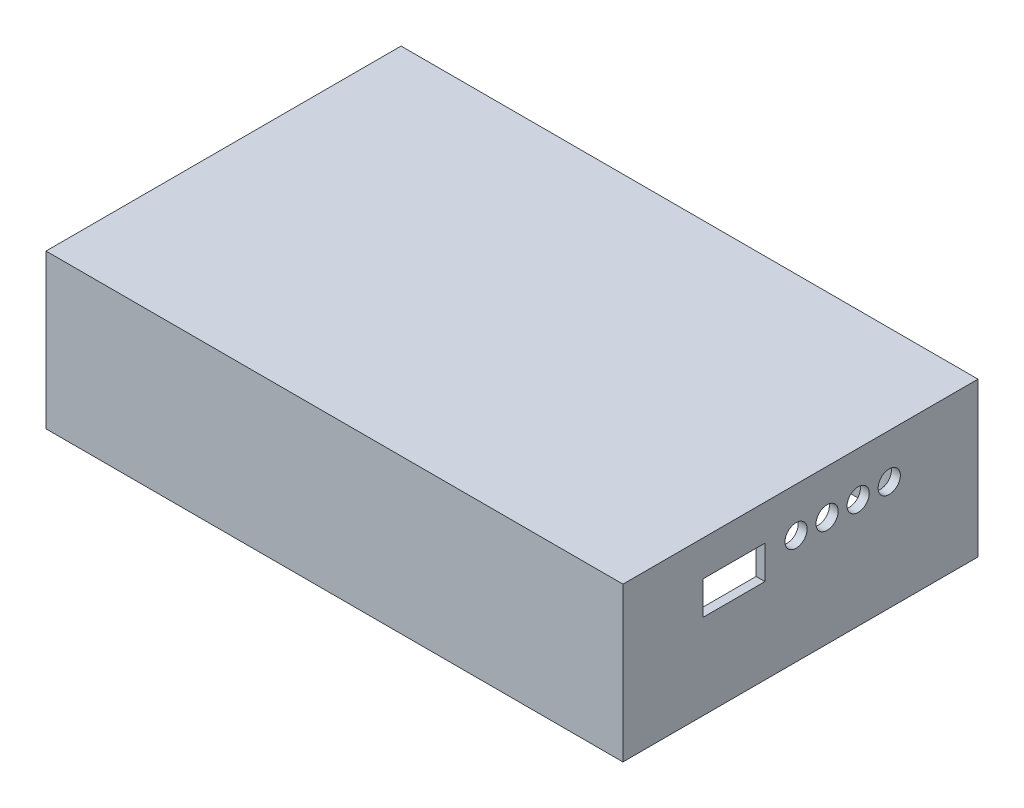
ISO-10303-21;
HEADER;
FILE_DESCRIPTION(('STEP AP214'),'2;1');
FILE_NAME('part.step','',(''),(''),'','','');
FILE_SCHEMA(('AUTOMOTIVE_DESIGN { 1 0 10303 214 1 1 1 1 }'));
ENDSEC;
DATA;
#1=APPLICATION_CONTEXT('core data for automotive mechanical design processes');
#2=APPLICATION_PROTOCOL_DEFINITION('international standard','automotive_design',2000,#1);
#3=PRODUCT_CONTEXT('',#1,'mechanical');
#4=PRODUCT('Part','Part','',(#3));
#5=PRODUCT_RELATED_PRODUCT_CATEGORY('part','',(#4));
#6=PRODUCT_DEFINITION_FORMATION('','',#4);
#7=PRODUCT_DEFINITION_CONTEXT('part definition',#1,'design');
#8=PRODUCT_DEFINITION('design','',#6,#7);
#9=PRODUCT_DEFINITION_SHAPE('','',#8);
#10=(LENGTH_UNIT() NAMED_UNIT(*) SI_UNIT(.MILLI.,.METRE.));
#11=(NAMED_UNIT(*) PLANE_ANGLE_UNIT() SI_UNIT($,.RADIAN.));
#12=(NAMED_UNIT(*) SI_UNIT($,.STERADIAN.) SOLID_ANGLE_UNIT());
#13=UNCERTAINTY_MEASURE_WITH_UNIT(LENGTH_MEASURE(1.E-05),#10,'distance_accuracy_value','');
#14=(GEOMETRIC_REPRESENTATION_CONTEXT(3) GLOBAL_UNCERTAINTY_ASSIGNED_CONTEXT((#13)) GLOBAL_UNIT_ASSIGNED_CONTEXT((#10,
#11,#12)) REPRESENTATION_CONTEXT('',''));
#15=CARTESIAN_POINT('',(0.,0.,0.));
#16=DIRECTION('',(0.,0.,1.));
#17=DIRECTION('',(1.,0.,0.));
#18=AXIS2_PLACEMENT_3D('',#15,#16,#17);
#19=CARTESIAN_POINT('',(0.,2.,0.));
#20=DIRECTION('',(-1.,0.,0.));
#21=DIRECTION('',(0.,0.,1.));
#22=AXIS2_PLACEMENT_3D('',#19,#20,#21);
#23=PLANE('',#22);
#24=DIRECTION('',(0.,-1.,0.));
#25=VECTOR('',#24,1.);
#26=CARTESIAN_POINT('',(0.,2.,-80.));
#27=LINE('',#26,#25);
#28=CARTESIAN_POINT('',(0.,2.,-80.));
#29=VERTEX_POINT('',#28);
#30=CARTESIAN_POINT('',(0.,-32.7,-80.));
#31=VERTEX_POINT('',#30);
#32=EDGE_CURVE('E284',#29,#31,#27,.T.);
#33=ORIENTED_EDGE('',*,*,#32,.T.);
#34=DIRECTION('',(0.,0.,-1.));
#35=VECTOR('',#34,1.);
#36=CARTESIAN_POINT('',(0.,-32.7,-80.));
#37=LINE('',#36,#35);
#38=CARTESIAN_POINT('',(0.,-32.7,0.));
#39=VERTEX_POINT('',#38);
#40=EDGE_CURVE('E262',#39,#31,#37,.T.);
#41=ORIENTED_EDGE('',*,*,#40,.F.);
#42=DIRECTION('',(0.,-1.,0.));
#43=VECTOR('',#42,1.);
#44=CARTESIAN_POINT('',(0.,2.,0.));
#45=LINE('',#44,#43);
#46=CARTESIAN_POINT('',(0.,2.,0.));
#47=VERTEX_POINT('',#46);
#48=EDGE_CURVE('E285',#47,#39,#45,.T.);
#49=ORIENTED_EDGE('',*,*,#48,.F.);
#50=DIRECTION('',(0.,0.,-1.));
#51=VECTOR('',#50,1.);
#52=CARTESIAN_POINT('',(0.,2.,0.));
#53=LINE('',#52,#51);
#54=EDGE_CURVE('E274',#47,#29,#53,.T.);
#55=ORIENTED_EDGE('',*,*,#54,.T.);
#56=EDGE_LOOP('',(#33,#41,#49,#55));
#57=FACE_BOUND('',#56,.T.);
#58=ADVANCED_FACE('F39',(#57),#23,.T.);
#59=CARTESIAN_POINT('',(0.,2.,0.));
#60=DIRECTION('',(0.,0.,-1.));
#61=DIRECTION('',(-1.,0.,0.));
#62=AXIS2_PLACEMENT_3D('',#59,#60,#61);
#63=PLANE('',#62);
#64=ORIENTED_EDGE('',*,*,#48,.T.);
#65=DIRECTION('',(-1.,0.,0.));
#66=VECTOR('',#65,1.);
#67=CARTESIAN_POINT('',(0.,-32.7,0.));
#68=LINE('',#67,#66);
#69=CARTESIAN_POINT('',(130.,-32.7,0.));
#70=VERTEX_POINT('',#69);
#71=EDGE_CURVE('E271',#70,#39,#68,.T.);
#72=ORIENTED_EDGE('',*,*,#71,.F.);
#73=DIRECTION('',(0.,-1.,0.));
#74=VECTOR('',#73,1.);
#75=CARTESIAN_POINT('',(130.,2.,0.));
#76=LINE('',#75,#74);
#77=CARTESIAN_POINT('',(130.,2.,0.));
#78=VERTEX_POINT('',#77);
#79=EDGE_CURVE('E288',#78,#70,#76,.T.);
#80=ORIENTED_EDGE('',*,*,#79,.F.);
#81=DIRECTION('',(1.,0.,0.));
#82=VECTOR('',#81,1.);
#83=CARTESIAN_POINT('',(0.,2.,0.));
#84=LINE('',#83,#82);
#85=EDGE_CURVE('E282',#47,#78,#84,.T.);
#86=ORIENTED_EDGE('',*,*,#85,.F.);
#87=EDGE_LOOP('',(#64,#72,#80,#86));
#88=FACE_BOUND('',#87,.T.);
#89=ADVANCED_FACE('F355',(#88),#63,.F.);
#90=CARTESIAN_POINT('',(130.,2.,0.));
#91=DIRECTION('',(-1.,0.,0.));
#92=DIRECTION('',(0.,0.,1.));
#93=AXIS2_PLACEMENT_3D('',#90,#91,#92);
#94=PLANE('',#93);
#95=DIRECTION('',(0.,0.,-1.));
#96=VECTOR('',#95,1.);
#97=CARTESIAN_POINT('',(130.,-13.5,-18.));
#98=LINE('',#97,#96);
#99=CARTESIAN_POINT('',(130.,-13.5,-18.));
#100=VERTEX_POINT('',#99);
#101=CARTESIAN_POINT('',(130.,-13.5,-32.));
#102=VERTEX_POINT('',#101);
#103=EDGE_CURVE('E163',#100,#102,#98,.T.);
#104=ORIENTED_EDGE('',*,*,#103,.F.);
#105=DIRECTION('',(0.,-1.,0.));
#106=VECTOR('',#105,1.);
#107=CARTESIAN_POINT('',(130.,-13.5,-18.));
#108=LINE('',#107,#106);
#109=CARTESIAN_POINT('',(130.,-6.,-18.));
#110=VERTEX_POINT('',#109);
#111=EDGE_CURVE('E53',#110,#100,#108,.T.);
#112=ORIENTED_EDGE('',*,*,#111,.F.);
#113=DIRECTION('',(0.,0.,1.));
#114=VECTOR('',#113,1.);
#115=CARTESIAN_POINT('',(130.,-6.,-18.));
#116=LINE('',#115,#114);
#117=CARTESIAN_POINT('',(130.,-6.,-32.));
#118=VERTEX_POINT('',#117);
#119=EDGE_CURVE('E170',#118,#110,#116,.T.);
#120=ORIENTED_EDGE('',*,*,#119,.F.);
#121=DIRECTION('',(0.,1.,0.));
#122=VECTOR('',#121,1.);
#123=CARTESIAN_POINT('',(130.,-13.5,-32.));
#124=LINE('',#123,#122);
#125=EDGE_CURVE('E154',#102,#118,#124,.T.);
#126=ORIENTED_EDGE('',*,*,#125,.F.);
#127=EDGE_LOOP('',(#104,#112,#120,#126));
#128=FACE_BOUND('',#127,.T.);
#129=CARTESIAN_POINT('',(130.,-8.,-39.));
#130=DIRECTION('',(1.,0.,0.));
#131=DIRECTION('',(0.,0.,-1.));
#132=AXIS2_PLACEMENT_3D('',#129,#130,#131);
#133=CIRCLE('',#132,2.5);
#134=CARTESIAN_POINT('',(130.,-8.,-41.5));
#135=VERTEX_POINT('',#134);
#136=EDGE_CURVE('E180',#135,#135,#133,.T.);
#137=ORIENTED_EDGE('',*,*,#136,.F.);
#138=EDGE_LOOP('',(#137));
#139=FACE_BOUND('',#138,.T.);
#140=CARTESIAN_POINT('',(130.,-8.,-46.));
#141=DIRECTION('',(1.,0.,0.));
#142=DIRECTION('',(0.,0.,-1.));
#143=AXIS2_PLACEMENT_3D('',#140,#141,#142);
#144=CIRCLE('',#143,2.5);
#145=CARTESIAN_POINT('',(130.,-8.,-48.5));
#146=VERTEX_POINT('',#145);
#147=EDGE_CURVE('E183',#146,#146,#144,.T.);
#148=ORIENTED_EDGE('',*,*,#147,.F.);
#149=EDGE_LOOP('',(#148));
#150=FACE_BOUND('',#149,.T.);
#151=CARTESIAN_POINT('',(130.,-8.,-53.));
#152=DIRECTION('',(1.,0.,0.));
#153=DIRECTION('',(0.,0.,-1.));
#154=AXIS2_PLACEMENT_3D('',#151,#152,#153);
#155=CIRCLE('',#154,2.49999999999999);
#156=CARTESIAN_POINT('',(130.,-8.,-55.5));
#157=VERTEX_POINT('',#156);
#158=EDGE_CURVE('E186',#157,#157,#155,.T.);
#159=ORIENTED_EDGE('',*,*,#158,.F.);
#160=EDGE_LOOP('',(#159));
#161=FACE_BOUND('',#160,.T.);
#162=CARTESIAN_POINT('',(130.,-8.,-60.));
#163=DIRECTION('',(1.,0.,0.));
#164=DIRECTION('',(0.,0.,-1.));
#165=AXIS2_PLACEMENT_3D('',#162,#163,#164);
#166=CIRCLE('',#165,2.50000000000002);
#167=CARTESIAN_POINT('',(130.,-8.,-62.5));
#168=VERTEX_POINT('',#167);
#169=EDGE_CURVE('E189',#168,#168,#166,.T.);
#170=ORIENTED_EDGE('',*,*,#169,.F.);
#171=EDGE_LOOP('',(#170));
#172=FACE_BOUND('',#171,.T.);
#173=ORIENTED_EDGE('',*,*,#79,.T.);
#174=DIRECTION('',(0.,0.,1.));
#175=VECTOR('',#174,1.);
#176=CARTESIAN_POINT('',(130.,-32.7,-80.));
#177=LINE('',#176,#175);
#178=CARTESIAN_POINT('',(130.,-32.7,-80.));
#179=VERTEX_POINT('',#178);
#180=EDGE_CURVE('E268',#179,#70,#177,.T.);
#181=ORIENTED_EDGE('',*,*,#180,.F.);
#182=DIRECTION('',(0.,-1.,0.));
#183=VECTOR('',#182,1.);
#184=CARTESIAN_POINT('',(130.,2.,-80.));
#185=LINE('',#184,#183);
#186=CARTESIAN_POINT('',(130.,2.,-80.));
#187=VERTEX_POINT('',#186);
#188=EDGE_CURVE('E290',#187,#179,#185,.T.);
#189=ORIENTED_EDGE('',*,*,#188,.F.);
#190=DIRECTION('',(0.,0.,-1.));
#191=VECTOR('',#190,1.);
#192=CARTESIAN_POINT('',(130.,2.,0.));
#193=LINE('',#192,#191);
#194=EDGE_CURVE('E280',#78,#187,#193,.T.);
#195=ORIENTED_EDGE('',*,*,#194,.F.);
#196=EDGE_LOOP('',(#173,#181,#189,#195));
#197=FACE_BOUND('',#196,.T.);
#198=ADVANCED_FACE('F167',(#128,#139,#150,#161,#172,#197),#94,.F.);
#199=CARTESIAN_POINT('',(0.,2.,-80.));
#200=DIRECTION('',(0.,0.,-1.));
#201=DIRECTION('',(-1.,0.,0.));
#202=AXIS2_PLACEMENT_3D('',#199,#200,#201);
#203=PLANE('',#202);
#204=ORIENTED_EDGE('',*,*,#188,.T.);
#205=DIRECTION('',(1.,0.,0.));
#206=VECTOR('',#205,1.);
#207=CARTESIAN_POINT('',(0.,-32.7,-80.));
#208=LINE('',#207,#206);
#209=EDGE_CURVE('E265',#31,#179,#208,.T.);
#210=ORIENTED_EDGE('',*,*,#209,.F.);
#211=ORIENTED_EDGE('',*,*,#32,.F.);
#212=DIRECTION('',(1.,0.,0.));
#213=VECTOR('',#212,1.);
#214=CARTESIAN_POINT('',(0.,2.,-80.));
#215=LINE('',#214,#213);
#216=EDGE_CURVE('E277',#29,#187,#215,.T.);
#217=ORIENTED_EDGE('',*,*,#216,.T.);
#218=EDGE_LOOP('',(#204,#210,#211,#217));
#219=FACE_BOUND('',#218,.T.);
#220=ADVANCED_FACE('F367',(#219),#203,.T.);
#221=CARTESIAN_POINT('',(0.,2.,0.));
#222=DIRECTION('',(0.,-1.,0.));
#223=DIRECTION('',(0.,0.,-1.));
#224=AXIS2_PLACEMENT_3D('',#221,#222,#223);
#225=PLANE('',#224);
#226=ORIENTED_EDGE('',*,*,#54,.F.);
#227=ORIENTED_EDGE('',*,*,#85,.T.);
#228=ORIENTED_EDGE('',*,*,#194,.T.);
#229=ORIENTED_EDGE('',*,*,#216,.F.);
#230=EDGE_LOOP('',(#226,#227,#228,#229));
#231=FACE_BOUND('',#230,.T.);
#232=ADVANCED_FACE('F331',(#231),#225,.F.);
#233=CARTESIAN_POINT('',(0.,-32.7,0.));
#234=DIRECTION('',(0.,1.,0.));
#235=DIRECTION('',(0.,0.,1.));
#236=AXIS2_PLACEMENT_3D('',#233,#234,#235);
#237=PLANE('',#236);
#238=ORIENTED_EDGE('',*,*,#40,.T.);
#239=ORIENTED_EDGE('',*,*,#209,.T.);
#240=ORIENTED_EDGE('',*,*,#180,.T.);
#241=ORIENTED_EDGE('',*,*,#71,.T.);
#242=EDGE_LOOP('',(#238,#239,#240,#241));
#243=FACE_BOUND('',#242,.T.);
#244=CARTESIAN_POINT('',(7.,-32.7,-73.));
#245=DIRECTION('',(0.,1.,0.));
#246=DIRECTION('',(0.,0.,-1.));
#247=AXIS2_PLACEMENT_3D('',#244,#245,#246);
#248=CIRCLE('',#247,7.);
#249=CARTESIAN_POINT('',(2.,-32.7,-68.1010205144336));
#250=VERTEX_POINT('',#249);
#251=CARTESIAN_POINT('',(11.8989794855664,-32.7,-78.));
#252=VERTEX_POINT('',#251);
#253=EDGE_CURVE('E206',#250,#252,#248,.T.);
#254=ORIENTED_EDGE('',*,*,#253,.F.);
#255=DIRECTION('',(0.,0.,-1.));
#256=VECTOR('',#255,1.);
#257=CARTESIAN_POINT('',(2.,-32.7,-68.1010205144336));
#258=LINE('',#257,#256);
#259=CARTESIAN_POINT('',(2.,-32.7,-11.8989794855664));
#260=VERTEX_POINT('',#259);
#261=EDGE_CURVE('E222',#260,#250,#258,.T.);
#262=ORIENTED_EDGE('',*,*,#261,.F.);
#263=CARTESIAN_POINT('',(7.,-32.7,-7.00000000000001));
#264=DIRECTION('',(0.,1.,0.));
#265=DIRECTION('',(0.,0.,-1.));
#266=AXIS2_PLACEMENT_3D('',#263,#264,#265);
#267=CIRCLE('',#266,7.);
#268=CARTESIAN_POINT('',(11.8989794855664,-32.7,-2.));
#269=VERTEX_POINT('',#268);
#270=EDGE_CURVE('E219',#269,#260,#267,.T.);
#271=ORIENTED_EDGE('',*,*,#270,.F.);
#272=DIRECTION('',(-1.,0.,0.));
#273=VECTOR('',#272,1.);
#274=CARTESIAN_POINT('',(11.8989794855664,-32.7,-2.));
#275=LINE('',#274,#273);
#276=CARTESIAN_POINT('',(118.101020514434,-32.7,-2.));
#277=VERTEX_POINT('',#276);
#278=EDGE_CURVE('E217',#277,#269,#275,.T.);
#279=ORIENTED_EDGE('',*,*,#278,.F.);
#280=CARTESIAN_POINT('',(123.,-32.7,-7.));
#281=DIRECTION('',(0.,1.,0.));
#282=DIRECTION('',(0.,0.,-1.));
#283=AXIS2_PLACEMENT_3D('',#280,#281,#282);
#284=CIRCLE('',#283,7.);
#285=CARTESIAN_POINT('',(128.,-32.7,-11.8989794855664));
#286=VERTEX_POINT('',#285);
#287=EDGE_CURVE('E215',#286,#277,#284,.T.);
#288=ORIENTED_EDGE('',*,*,#287,.F.);
#289=DIRECTION('',(0.,0.,1.));
#290=VECTOR('',#289,1.);
#291=CARTESIAN_POINT('',(128.,-32.7,-68.1010205144337));
#292=LINE('',#291,#290);
#293=CARTESIAN_POINT('',(128.,-32.7,-68.1010205144337));
#294=VERTEX_POINT('',#293);
#295=EDGE_CURVE('E213',#294,#286,#292,.T.);
#296=ORIENTED_EDGE('',*,*,#295,.F.);
#297=CARTESIAN_POINT('',(123.,-32.7,-73.));
#298=DIRECTION('',(0.,1.,0.));
#299=DIRECTION('',(0.,0.,-1.));
#300=AXIS2_PLACEMENT_3D('',#297,#298,#299);
#301=CIRCLE('',#300,7.);
#302=CARTESIAN_POINT('',(118.101020514434,-32.7,-78.));
#303=VERTEX_POINT('',#302);
#304=EDGE_CURVE('E211',#303,#294,#301,.T.);
#305=ORIENTED_EDGE('',*,*,#304,.F.);
#306=DIRECTION('',(1.,0.,0.));
#307=VECTOR('',#306,1.);
#308=CARTESIAN_POINT('',(11.8989794855664,-32.7,-78.));
#309=LINE('',#308,#307);
#310=EDGE_CURVE('E208',#252,#303,#309,.T.);
#311=ORIENTED_EDGE('',*,*,#310,.F.);
#312=EDGE_LOOP('',(#254,#262,#271,#279,#288,#296,#305,#311));
#313=FACE_BOUND('',#312,.T.);
#314=CARTESIAN_POINT('',(123.,-32.7,-7.));
#315=DIRECTION('',(0.,-1.,0.));
#316=DIRECTION('',(0.,0.,-1.));
#317=AXIS2_PLACEMENT_3D('',#314,#315,#316);
#318=CIRCLE('',#317,5.09999999999998);
#319=CARTESIAN_POINT('',(123.,-32.7,-12.1));
#320=VERTEX_POINT('',#319);
#321=EDGE_CURVE('E202',#320,#320,#318,.T.);
#322=ORIENTED_EDGE('',*,*,#321,.F.);
#323=EDGE_LOOP('',(#322));
#324=FACE_BOUND('',#323,.T.);
#325=CARTESIAN_POINT('',(123.,-32.7,-73.));
#326=DIRECTION('',(0.,-1.,0.));
#327=DIRECTION('',(0.,0.,-1.));
#328=AXIS2_PLACEMENT_3D('',#325,#326,#327);
#329=CIRCLE('',#328,5.09999999999998);
#330=CARTESIAN_POINT('',(123.,-32.7,-78.1));
#331=VERTEX_POINT('',#330);
#332=EDGE_CURVE('E199',#331,#331,#329,.T.);
#333=ORIENTED_EDGE('',*,*,#332,.F.);
#334=EDGE_LOOP('',(#333));
#335=FACE_BOUND('',#334,.T.);
#336=CARTESIAN_POINT('',(7.,-32.7,-7.00000000000001));
#337=DIRECTION('',(0.,-1.,0.));
#338=DIRECTION('',(0.,0.,-1.));
#339=AXIS2_PLACEMENT_3D('',#336,#337,#338);
#340=CIRCLE('',#339,5.1);
#341=CARTESIAN_POINT('',(7.,-32.7,-12.1));
#342=VERTEX_POINT('',#341);
#343=EDGE_CURVE('E195',#342,#342,#340,.T.);
#344=ORIENTED_EDGE('',*,*,#343,.F.);
#345=EDGE_LOOP('',(#344));
#346=FACE_BOUND('',#345,.T.);
#347=CARTESIAN_POINT('',(7.,-32.7,-73.));
#348=DIRECTION('',(0.,-1.,0.));
#349=DIRECTION('',(0.,0.,-1.));
#350=AXIS2_PLACEMENT_3D('',#347,#348,#349);
#351=CIRCLE('',#350,5.1);
#352=CARTESIAN_POINT('',(7.,-32.7,-78.1));
#353=VERTEX_POINT('',#352);
#354=EDGE_CURVE('E192',#353,#353,#351,.T.);
#355=ORIENTED_EDGE('',*,*,#354,.F.);
#356=EDGE_LOOP('',(#355));
#357=FACE_BOUND('',#356,.T.);
#358=ADVANCED_FACE('F327',(#243,#313,#324,#335,#346,#357),#237,.F.);
#359=CARTESIAN_POINT('',(7.,-32.7,-73.));
#360=DIRECTION('',(0.,1.,0.));
#361=DIRECTION('',(0.,0.,1.));
#362=AXIS2_PLACEMENT_3D('',#359,#360,#361);
#363=CYLINDRICAL_SURFACE('',#362,7.);
#364=CARTESIAN_POINT('',(7.,0.,-73.));
#365=DIRECTION('',(0.,1.,0.));
#366=DIRECTION('',(0.,0.,-1.));
#367=AXIS2_PLACEMENT_3D('',#364,#365,#366);
#368=CIRCLE('',#367,7.);
#369=CARTESIAN_POINT('',(2.,0.,-68.1010205144336));
#370=VERTEX_POINT('',#369);
#371=CARTESIAN_POINT('',(11.8989794855664,0.,-78.));
#372=VERTEX_POINT('',#371);
#373=EDGE_CURVE('E205',#370,#372,#368,.T.);
#374=ORIENTED_EDGE('',*,*,#373,.F.);
#375=DIRECTION('',(0.,1.,0.));
#376=VECTOR('',#375,1.);
#377=CARTESIAN_POINT('',(2.,-32.7,-68.1010205144336));
#378=LINE('',#377,#376);
#379=EDGE_CURVE('E224',#250,#370,#378,.T.);
#380=ORIENTED_EDGE('',*,*,#379,.F.);
#381=ORIENTED_EDGE('',*,*,#253,.T.);
#382=DIRECTION('',(0.,1.,0.));
#383=VECTOR('',#382,1.);
#384=CARTESIAN_POINT('',(11.8989794855664,-32.7,-78.));
#385=LINE('',#384,#383);
#386=EDGE_CURVE('E259',#252,#372,#385,.T.);
#387=ORIENTED_EDGE('',*,*,#386,.T.);
#388=EDGE_LOOP('',(#374,#380,#381,#387));
#389=FACE_BOUND('',#388,.T.);
#390=ADVANCED_FACE('F330',(#389),#363,.T.);
#391=CARTESIAN_POINT('',(11.8989794855664,-32.7,-78.));
#392=DIRECTION('',(0.,0.,1.));
#393=DIRECTION('',(1.,0.,0.));
#394=AXIS2_PLACEMENT_3D('',#391,#392,#393);
#395=PLANE('',#394);
#396=DIRECTION('',(1.,0.,0.));
#397=VECTOR('',#396,1.);
#398=CARTESIAN_POINT('',(11.8989794855664,0.,-78.));
#399=LINE('',#398,#397);
#400=CARTESIAN_POINT('',(118.101020514434,0.,-78.));
#401=VERTEX_POINT('',#400);
#402=EDGE_CURVE('E226',#372,#401,#399,.T.);
#403=ORIENTED_EDGE('',*,*,#402,.F.);
#404=ORIENTED_EDGE('',*,*,#386,.F.);
#405=ORIENTED_EDGE('',*,*,#310,.T.);
#406=DIRECTION('',(0.,1.,0.));
#407=VECTOR('',#406,1.);
#408=CARTESIAN_POINT('',(118.101020514434,-32.7,-78.));
#409=LINE('',#408,#407);
#410=EDGE_CURVE('E256',#303,#401,#409,.T.);
#411=ORIENTED_EDGE('',*,*,#410,.T.);
#412=EDGE_LOOP('',(#403,#404,#405,#411));
#413=FACE_BOUND('',#412,.T.);
#414=ADVANCED_FACE('F387',(#413),#395,.T.);
#415=CARTESIAN_POINT('',(123.,-32.7,-73.));
#416=DIRECTION('',(0.,1.,0.));
#417=DIRECTION('',(0.,0.,1.));
#418=AXIS2_PLACEMENT_3D('',#415,#416,#417);
#419=CYLINDRICAL_SURFACE('',#418,7.);
#420=CARTESIAN_POINT('',(123.,0.,-73.));
#421=DIRECTION('',(0.,1.,0.));
#422=DIRECTION('',(0.,0.,-1.));
#423=AXIS2_PLACEMENT_3D('',#420,#421,#422);
#424=CIRCLE('',#423,7.);
#425=CARTESIAN_POINT('',(128.,0.,-68.1010205144337));
#426=VERTEX_POINT('',#425);
#427=EDGE_CURVE('E228',#401,#426,#424,.T.);
#428=ORIENTED_EDGE('',*,*,#427,.F.);
#429=ORIENTED_EDGE('',*,*,#410,.F.);
#430=ORIENTED_EDGE('',*,*,#304,.T.);
#431=DIRECTION('',(0.,1.,0.));
#432=VECTOR('',#431,1.);
#433=CARTESIAN_POINT('',(128.,-32.7,-68.1010205144337));
#434=LINE('',#433,#432);
#435=EDGE_CURVE('E253',#294,#426,#434,.T.);
#436=ORIENTED_EDGE('',*,*,#435,.T.);
#437=EDGE_LOOP('',(#428,#429,#430,#436));
#438=FACE_BOUND('',#437,.T.);
#439=ADVANCED_FACE('F391',(#438),#419,.T.);
#440=CARTESIAN_POINT('',(128.,-32.7,-68.1010205144337));
#441=DIRECTION('',(-1.,0.,0.));
#442=DIRECTION('',(0.,0.,1.));
#443=AXIS2_PLACEMENT_3D('',#440,#441,#442);
#444=PLANE('',#443);
#445=DIRECTION('',(0.,1.,0.));
#446=VECTOR('',#445,1.);
#447=CARTESIAN_POINT('',(128.,-32.7,-18.));
#448=LINE('',#447,#446);
#449=CARTESIAN_POINT('',(128.,-13.5,-18.));
#450=VERTEX_POINT('',#449);
#451=CARTESIAN_POINT('',(128.,-6.,-18.));
#452=VERTEX_POINT('',#451);
#453=EDGE_CURVE('E307',#450,#452,#448,.T.);
#454=ORIENTED_EDGE('',*,*,#453,.F.);
#455=DIRECTION('',(0.,0.,1.));
#456=VECTOR('',#455,1.);
#457=CARTESIAN_POINT('',(128.,-13.5,-68.1010205144337));
#458=LINE('',#457,#456);
#459=CARTESIAN_POINT('',(128.,-13.5,-32.));
#460=VERTEX_POINT('',#459);
#461=EDGE_CURVE('E287',#460,#450,#458,.T.);
#462=ORIENTED_EDGE('',*,*,#461,.F.);
#463=DIRECTION('',(0.,-1.,0.));
#464=VECTOR('',#463,1.);
#465=CARTESIAN_POINT('',(128.,-32.7,-32.));
#466=LINE('',#465,#464);
#467=CARTESIAN_POINT('',(128.,-6.,-32.));
#468=VERTEX_POINT('',#467);
#469=EDGE_CURVE('E157',#468,#460,#466,.T.);
#470=ORIENTED_EDGE('',*,*,#469,.F.);
#471=DIRECTION('',(0.,0.,-1.));
#472=VECTOR('',#471,1.);
#473=CARTESIAN_POINT('',(128.,-6.,-68.1010205144337));
#474=LINE('',#473,#472);
#475=EDGE_CURVE('E305',#452,#468,#474,.T.);
#476=ORIENTED_EDGE('',*,*,#475,.F.);
#477=EDGE_LOOP('',(#454,#462,#470,#476));
#478=FACE_BOUND('',#477,.T.);
#479=CARTESIAN_POINT('',(128.,-8.,-39.));
#480=DIRECTION('',(-1.,0.,0.));
#481=DIRECTION('',(0.,0.,1.));
#482=AXIS2_PLACEMENT_3D('',#479,#480,#481);
#483=CIRCLE('',#482,2.5);
#484=CARTESIAN_POINT('',(128.,-8.,-36.5));
#485=VERTEX_POINT('',#484);
#486=EDGE_CURVE('E196',#485,#485,#483,.T.);
#487=ORIENTED_EDGE('',*,*,#486,.F.);
#488=EDGE_LOOP('',(#487));
#489=FACE_BOUND('',#488,.T.);
#490=CARTESIAN_POINT('',(128.,-8.,-46.));
#491=DIRECTION('',(-1.,0.,0.));
#492=DIRECTION('',(0.,0.,1.));
#493=AXIS2_PLACEMENT_3D('',#490,#491,#492);
#494=CIRCLE('',#493,2.5);
#495=CARTESIAN_POINT('',(128.,-8.,-43.5));
#496=VERTEX_POINT('',#495);
#497=EDGE_CURVE('E298',#496,#496,#494,.T.);
#498=ORIENTED_EDGE('',*,*,#497,.F.);
#499=EDGE_LOOP('',(#498));
#500=FACE_BOUND('',#499,.T.);
#501=CARTESIAN_POINT('',(128.,-8.,-53.));
#502=DIRECTION('',(-1.,0.,0.));
#503=DIRECTION('',(0.,0.,1.));
#504=AXIS2_PLACEMENT_3D('',#501,#502,#503);
#505=CIRCLE('',#504,2.49999999999999);
#506=CARTESIAN_POINT('',(128.,-8.,-50.5));
#507=VERTEX_POINT('',#506);
#508=EDGE_CURVE('E295',#507,#507,#505,.T.);
#509=ORIENTED_EDGE('',*,*,#508,.F.);
#510=EDGE_LOOP('',(#509));
#511=FACE_BOUND('',#510,.T.);
#512=CARTESIAN_POINT('',(128.,-8.,-60.));
#513=DIRECTION('',(-1.,0.,0.));
#514=DIRECTION('',(0.,0.,1.));
#515=AXIS2_PLACEMENT_3D('',#512,#513,#514);
#516=CIRCLE('',#515,2.50000000000002);
#517=CARTESIAN_POINT('',(128.,-8.,-57.5));
#518=VERTEX_POINT('',#517);
#519=EDGE_CURVE('E177',#518,#518,#516,.T.);
#520=ORIENTED_EDGE('',*,*,#519,.F.);
#521=EDGE_LOOP('',(#520));
#522=FACE_BOUND('',#521,.T.);
#523=DIRECTION('',(0.,0.,1.));
#524=VECTOR('',#523,1.);
#525=CARTESIAN_POINT('',(128.,0.,-68.1010205144337));
#526=LINE('',#525,#524);
#527=CARTESIAN_POINT('',(128.,0.,-11.8989794855664));
#528=VERTEX_POINT('',#527);
#529=EDGE_CURVE('E230',#426,#528,#526,.T.);
#530=ORIENTED_EDGE('',*,*,#529,.F.);
#531=ORIENTED_EDGE('',*,*,#435,.F.);
#532=ORIENTED_EDGE('',*,*,#295,.T.);
#533=DIRECTION('',(0.,1.,0.));
#534=VECTOR('',#533,1.);
#535=CARTESIAN_POINT('',(128.,-32.7,-11.8989794855664));
#536=LINE('',#535,#534);
#537=EDGE_CURVE('E250',#286,#528,#536,.T.);
#538=ORIENTED_EDGE('',*,*,#537,.T.);
#539=EDGE_LOOP('',(#530,#531,#532,#538));
#540=FACE_BOUND('',#539,.T.);
#541=ADVANCED_FACE('F395',(#478,#489,#500,#511,#522,#540),#444,.T.);
#542=CARTESIAN_POINT('',(123.,-32.7,-7.));
#543=DIRECTION('',(0.,1.,0.));
#544=DIRECTION('',(0.,0.,1.));
#545=AXIS2_PLACEMENT_3D('',#542,#543,#544);
#546=CYLINDRICAL_SURFACE('',#545,7.);
#547=CARTESIAN_POINT('',(123.,0.,-7.));
#548=DIRECTION('',(0.,1.,0.));
#549=DIRECTION('',(0.,0.,-1.));
#550=AXIS2_PLACEMENT_3D('',#547,#548,#549);
#551=CIRCLE('',#550,7.);
#552=CARTESIAN_POINT('',(118.101020514434,0.,-2.));
#553=VERTEX_POINT('',#552);
#554=EDGE_CURVE('E232',#528,#553,#551,.T.);
#555=ORIENTED_EDGE('',*,*,#554,.F.);
#556=ORIENTED_EDGE('',*,*,#537,.F.);
#557=ORIENTED_EDGE('',*,*,#287,.T.);
#558=DIRECTION('',(0.,1.,0.));
#559=VECTOR('',#558,1.);
#560=CARTESIAN_POINT('',(118.101020514434,-32.7,-2.));
#561=LINE('',#560,#559);
#562=EDGE_CURVE('E247',#277,#553,#561,.T.);
#563=ORIENTED_EDGE('',*,*,#562,.T.);
#564=EDGE_LOOP('',(#555,#556,#557,#563));
#565=FACE_BOUND('',#564,.T.);
#566=ADVANCED_FACE('F399',(#565),#546,.T.);
#567=CARTESIAN_POINT('',(11.8989794855664,-32.7,-2.));
#568=DIRECTION('',(0.,0.,-1.));
#569=DIRECTION('',(-1.,0.,0.));
#570=AXIS2_PLACEMENT_3D('',#567,#568,#569);
#571=PLANE('',#570);
#572=DIRECTION('',(-1.,0.,0.));
#573=VECTOR('',#572,1.);
#574=CARTESIAN_POINT('',(11.8989794855664,0.,-2.));
#575=LINE('',#574,#573);
#576=CARTESIAN_POINT('',(11.8989794855664,0.,-2.));
#577=VERTEX_POINT('',#576);
#578=EDGE_CURVE('E234',#553,#577,#575,.T.);
#579=ORIENTED_EDGE('',*,*,#578,.F.);
#580=ORIENTED_EDGE('',*,*,#562,.F.);
#581=ORIENTED_EDGE('',*,*,#278,.T.);
#582=DIRECTION('',(0.,1.,0.));
#583=VECTOR('',#582,1.);
#584=CARTESIAN_POINT('',(11.8989794855664,-32.7,-2.));
#585=LINE('',#584,#583);
#586=EDGE_CURVE('E244',#269,#577,#585,.T.);
#587=ORIENTED_EDGE('',*,*,#586,.T.);
#588=EDGE_LOOP('',(#579,#580,#581,#587));
#589=FACE_BOUND('',#588,.T.);
#590=ADVANCED_FACE('F403',(#589),#571,.T.);
#591=CARTESIAN_POINT('',(7.,-32.7,-7.00000000000001));
#592=DIRECTION('',(0.,1.,0.));
#593=DIRECTION('',(0.,0.,1.));
#594=AXIS2_PLACEMENT_3D('',#591,#592,#593);
#595=CYLINDRICAL_SURFACE('',#594,7.);
#596=CARTESIAN_POINT('',(7.,0.,-7.00000000000001));
#597=DIRECTION('',(0.,1.,0.));
#598=DIRECTION('',(0.,0.,-1.));
#599=AXIS2_PLACEMENT_3D('',#596,#597,#598);
#600=CIRCLE('',#599,7.);
#601=CARTESIAN_POINT('',(2.,0.,-11.8989794855664));
#602=VERTEX_POINT('',#601);
#603=EDGE_CURVE('E236',#577,#602,#600,.T.);
#604=ORIENTED_EDGE('',*,*,#603,.F.);
#605=ORIENTED_EDGE('',*,*,#586,.F.);
#606=ORIENTED_EDGE('',*,*,#270,.T.);
#607=DIRECTION('',(0.,1.,0.));
#608=VECTOR('',#607,1.);
#609=CARTESIAN_POINT('',(2.,-32.7,-11.8989794855664));
#610=LINE('',#609,#608);
#611=EDGE_CURVE('E241',#260,#602,#610,.T.);
#612=ORIENTED_EDGE('',*,*,#611,.T.);
#613=EDGE_LOOP('',(#604,#605,#606,#612));
#614=FACE_BOUND('',#613,.T.);
#615=ADVANCED_FACE('F407',(#614),#595,.T.);
#616=CARTESIAN_POINT('',(2.,-32.7,-68.1010205144336));
#617=DIRECTION('',(1.,0.,0.));
#618=DIRECTION('',(0.,0.,-1.));
#619=AXIS2_PLACEMENT_3D('',#616,#617,#618);
#620=PLANE('',#619);
#621=DIRECTION('',(0.,0.,-1.));
#622=VECTOR('',#621,1.);
#623=CARTESIAN_POINT('',(2.,0.,-68.1010205144336));
#624=LINE('',#623,#622);
#625=EDGE_CURVE('E209',#602,#370,#624,.T.);
#626=ORIENTED_EDGE('',*,*,#625,.F.);
#627=ORIENTED_EDGE('',*,*,#611,.F.);
#628=ORIENTED_EDGE('',*,*,#261,.T.);
#629=ORIENTED_EDGE('',*,*,#379,.T.);
#630=EDGE_LOOP('',(#626,#627,#628,#629));
#631=FACE_BOUND('',#630,.T.);
#632=ADVANCED_FACE('F411',(#631),#620,.T.);
#633=CARTESIAN_POINT('',(123.,-32.7,-7.));
#634=DIRECTION('',(0.,1.,0.));
#635=DIRECTION('',(0.,0.,1.));
#636=AXIS2_PLACEMENT_3D('',#633,#634,#635);
#637=CYLINDRICAL_SURFACE('',#636,5.09999999999998);
#638=CARTESIAN_POINT('',(123.,-29.5,-7.));
#639=DIRECTION('',(0.,-1.,0.));
#640=DIRECTION('',(0.,0.,-1.));
#641=AXIS2_PLACEMENT_3D('',#638,#639,#640);
#642=CIRCLE('',#641,5.09999999999998);
#643=CARTESIAN_POINT('',(123.,-29.5,-12.1));
#644=VERTEX_POINT('',#643);
#645=EDGE_CURVE('E312',#644,#644,#642,.T.);
#646=ORIENTED_EDGE('',*,*,#645,.F.);
#647=EDGE_LOOP('',(#646));
#648=FACE_BOUND('',#647,.T.);
#649=ORIENTED_EDGE('',*,*,#321,.T.);
#650=EDGE_LOOP('',(#649));
#651=FACE_BOUND('',#650,.T.);
#652=ADVANCED_FACE('F323',(#648,#651),#637,.F.);
#653=CARTESIAN_POINT('',(123.,-32.7,-73.));
#654=DIRECTION('',(0.,1.,0.));
#655=DIRECTION('',(0.,0.,1.));
#656=AXIS2_PLACEMENT_3D('',#653,#654,#655);
#657=CYLINDRICAL_SURFACE('',#656,5.09999999999998);
#658=CARTESIAN_POINT('',(123.,-29.5,-73.));
#659=DIRECTION('',(0.,-1.,0.));
#660=DIRECTION('',(0.,0.,-1.));
#661=AXIS2_PLACEMENT_3D('',#658,#659,#660);
#662=CIRCLE('',#661,5.09999999999998);
#663=CARTESIAN_POINT('',(123.,-29.5,-78.1));
#664=VERTEX_POINT('',#663);
#665=EDGE_CURVE('E46',#664,#664,#662,.T.);
#666=ORIENTED_EDGE('',*,*,#665,.F.);
#667=EDGE_LOOP('',(#666));
#668=FACE_BOUND('',#667,.T.);
#669=ORIENTED_EDGE('',*,*,#332,.T.);
#670=EDGE_LOOP('',(#669));
#671=FACE_BOUND('',#670,.T.);
#672=ADVANCED_FACE('F319',(#668,#671),#657,.F.);
#673=CARTESIAN_POINT('',(7.,-32.7,-7.00000000000001));
#674=DIRECTION('',(0.,1.,0.));
#675=DIRECTION('',(0.,0.,1.));
#676=AXIS2_PLACEMENT_3D('',#673,#674,#675);
#677=CYLINDRICAL_SURFACE('',#676,5.1);
#678=CARTESIAN_POINT('',(7.,-29.5,-7.00000000000001));
#679=DIRECTION('',(0.,-1.,0.));
#680=DIRECTION('',(0.,0.,-1.));
#681=AXIS2_PLACEMENT_3D('',#678,#679,#680);
#682=CIRCLE('',#681,5.1);
#683=CARTESIAN_POINT('',(7.,-29.5,-12.1));
#684=VERTEX_POINT('',#683);
#685=EDGE_CURVE('E309',#684,#684,#682,.T.);
#686=ORIENTED_EDGE('',*,*,#685,.F.);
#687=EDGE_LOOP('',(#686));
#688=FACE_BOUND('',#687,.T.);
#689=ORIENTED_EDGE('',*,*,#343,.T.);
#690=EDGE_LOOP('',(#689));
#691=FACE_BOUND('',#690,.T.);
#692=ADVANCED_FACE('F322',(#688,#691),#677,.F.);
#693=CARTESIAN_POINT('',(7.,-32.7,-73.));
#694=DIRECTION('',(0.,1.,0.));
#695=DIRECTION('',(0.,0.,1.));
#696=AXIS2_PLACEMENT_3D('',#693,#694,#695);
#697=CYLINDRICAL_SURFACE('',#696,5.1);
#698=CARTESIAN_POINT('',(7.,-29.5,-73.));
#699=DIRECTION('',(0.,-1.,0.));
#700=DIRECTION('',(0.,0.,-1.));
#701=AXIS2_PLACEMENT_3D('',#698,#699,#700);
#702=CIRCLE('',#701,5.1);
#703=CARTESIAN_POINT('',(7.,-29.5,-78.1));
#704=VERTEX_POINT('',#703);
#705=EDGE_CURVE('E11',#704,#704,#702,.T.);
#706=ORIENTED_EDGE('',*,*,#705,.F.);
#707=EDGE_LOOP('',(#706));
#708=FACE_BOUND('',#707,.T.);
#709=ORIENTED_EDGE('',*,*,#354,.T.);
#710=EDGE_LOOP('',(#709));
#711=FACE_BOUND('',#710,.T.);
#712=ADVANCED_FACE('F338',(#708,#711),#697,.F.);
#713=CARTESIAN_POINT('',(0.,0.,0.));
#714=DIRECTION('',(0.,-1.,0.));
#715=DIRECTION('',(0.,0.,-1.));
#716=AXIS2_PLACEMENT_3D('',#713,#714,#715);
#717=PLANE('',#716);
#718=ORIENTED_EDGE('',*,*,#373,.T.);
#719=ORIENTED_EDGE('',*,*,#402,.T.);
#720=ORIENTED_EDGE('',*,*,#427,.T.);
#721=ORIENTED_EDGE('',*,*,#529,.T.);
#722=ORIENTED_EDGE('',*,*,#554,.T.);
#723=ORIENTED_EDGE('',*,*,#578,.T.);
#724=ORIENTED_EDGE('',*,*,#603,.T.);
#725=ORIENTED_EDGE('',*,*,#625,.T.);
#726=EDGE_LOOP('',(#718,#719,#720,#721,#722,#723,#724,#725));
#727=FACE_BOUND('',#726,.T.);
#728=ADVANCED_FACE('F340',(#727),#717,.T.);
#729=CARTESIAN_POINT('',(120.,-8.,-60.));
#730=DIRECTION('',(1.,0.,0.));
#731=DIRECTION('',(0.,0.,-1.));
#732=AXIS2_PLACEMENT_3D('',#729,#730,#731);
#733=CYLINDRICAL_SURFACE('',#732,2.50000000000002);
#734=ORIENTED_EDGE('',*,*,#519,.T.);
#735=EDGE_LOOP('',(#734));
#736=FACE_BOUND('',#735,.T.);
#737=ORIENTED_EDGE('',*,*,#169,.T.);
#738=EDGE_LOOP('',(#737));
#739=FACE_BOUND('',#738,.T.);
#740=ADVANCED_FACE('F347',(#736,#739),#733,.F.);
#741=CARTESIAN_POINT('',(120.,-8.,-53.));
#742=DIRECTION('',(1.,0.,0.));
#743=DIRECTION('',(0.,0.,-1.));
#744=AXIS2_PLACEMENT_3D('',#741,#742,#743);
#745=CYLINDRICAL_SURFACE('',#744,2.49999999999999);
#746=ORIENTED_EDGE('',*,*,#508,.T.);
#747=EDGE_LOOP('',(#746));
#748=FACE_BOUND('',#747,.T.);
#749=ORIENTED_EDGE('',*,*,#158,.T.);
#750=EDGE_LOOP('',(#749));
#751=FACE_BOUND('',#750,.T.);
#752=ADVANCED_FACE('F457',(#748,#751),#745,.F.);
#753=CARTESIAN_POINT('',(120.,-8.,-46.));
#754=DIRECTION('',(1.,0.,0.));
#755=DIRECTION('',(0.,0.,-1.));
#756=AXIS2_PLACEMENT_3D('',#753,#754,#755);
#757=CYLINDRICAL_SURFACE('',#756,2.5);
#758=ORIENTED_EDGE('',*,*,#497,.T.);
#759=EDGE_LOOP('',(#758));
#760=FACE_BOUND('',#759,.T.);
#761=ORIENTED_EDGE('',*,*,#147,.T.);
#762=EDGE_LOOP('',(#761));
#763=FACE_BOUND('',#762,.T.);
#764=ADVANCED_FACE('F453',(#760,#763),#757,.F.);
#765=CARTESIAN_POINT('',(120.,-8.,-39.));
#766=DIRECTION('',(1.,0.,0.));
#767=DIRECTION('',(0.,0.,-1.));
#768=AXIS2_PLACEMENT_3D('',#765,#766,#767);
#769=CYLINDRICAL_SURFACE('',#768,2.5);
#770=ORIENTED_EDGE('',*,*,#486,.T.);
#771=EDGE_LOOP('',(#770));
#772=FACE_BOUND('',#771,.T.);
#773=ORIENTED_EDGE('',*,*,#136,.T.);
#774=EDGE_LOOP('',(#773));
#775=FACE_BOUND('',#774,.T.);
#776=ADVANCED_FACE('F450',(#772,#775),#769,.F.);
#777=CARTESIAN_POINT('',(120.,-13.5,-18.));
#778=DIRECTION('',(0.,0.,1.));
#779=DIRECTION('',(1.,0.,0.));
#780=AXIS2_PLACEMENT_3D('',#777,#778,#779);
#781=PLANE('',#780);
#782=ORIENTED_EDGE('',*,*,#453,.T.);
#783=DIRECTION('',(1.,0.,0.));
#784=VECTOR('',#783,1.);
#785=CARTESIAN_POINT('',(120.,-6.,-18.));
#786=LINE('',#785,#784);
#787=EDGE_CURVE('E175',#452,#110,#786,.T.);
#788=ORIENTED_EDGE('',*,*,#787,.T.);
#789=ORIENTED_EDGE('',*,*,#111,.T.);
#790=DIRECTION('',(1.,0.,0.));
#791=VECTOR('',#790,1.);
#792=CARTESIAN_POINT('',(120.,-13.5,-18.));
#793=LINE('',#792,#791);
#794=EDGE_CURVE('E160',#450,#100,#793,.T.);
#795=ORIENTED_EDGE('',*,*,#794,.F.);
#796=EDGE_LOOP('',(#782,#788,#789,#795));
#797=FACE_BOUND('',#796,.T.);
#798=ADVANCED_FACE('F442',(#797),#781,.F.);
#799=CARTESIAN_POINT('',(120.,-6.,-18.));
#800=DIRECTION('',(0.,1.,0.));
#801=DIRECTION('',(0.,0.,1.));
#802=AXIS2_PLACEMENT_3D('',#799,#800,#801);
#803=PLANE('',#802);
#804=ORIENTED_EDGE('',*,*,#475,.T.);
#805=DIRECTION('',(1.,0.,0.));
#806=VECTOR('',#805,1.);
#807=CARTESIAN_POINT('',(120.,-6.,-32.));
#808=LINE('',#807,#806);
#809=EDGE_CURVE('E159',#468,#118,#808,.T.);
#810=ORIENTED_EDGE('',*,*,#809,.T.);
#811=ORIENTED_EDGE('',*,*,#119,.T.);
#812=ORIENTED_EDGE('',*,*,#787,.F.);
#813=EDGE_LOOP('',(#804,#810,#811,#812));
#814=FACE_BOUND('',#813,.T.);
#815=ADVANCED_FACE('F439',(#814),#803,.F.);
#816=CARTESIAN_POINT('',(120.,-13.5,-32.));
#817=DIRECTION('',(0.,0.,-1.));
#818=DIRECTION('',(-1.,0.,0.));
#819=AXIS2_PLACEMENT_3D('',#816,#817,#818);
#820=PLANE('',#819);
#821=ORIENTED_EDGE('',*,*,#469,.T.);
#822=DIRECTION('',(1.,0.,0.));
#823=VECTOR('',#822,1.);
#824=CARTESIAN_POINT('',(120.,-13.5,-32.));
#825=LINE('',#824,#823);
#826=EDGE_CURVE('E61',#460,#102,#825,.T.);
#827=ORIENTED_EDGE('',*,*,#826,.T.);
#828=ORIENTED_EDGE('',*,*,#125,.T.);
#829=ORIENTED_EDGE('',*,*,#809,.F.);
#830=EDGE_LOOP('',(#821,#827,#828,#829));
#831=FACE_BOUND('',#830,.T.);
#832=ADVANCED_FACE('F151',(#831),#820,.F.);
#833=CARTESIAN_POINT('',(120.,-13.5,-18.));
#834=DIRECTION('',(0.,-1.,0.));
#835=DIRECTION('',(0.,0.,-1.));
#836=AXIS2_PLACEMENT_3D('',#833,#834,#835);
#837=PLANE('',#836);
#838=ORIENTED_EDGE('',*,*,#461,.T.);
#839=ORIENTED_EDGE('',*,*,#794,.T.);
#840=ORIENTED_EDGE('',*,*,#103,.T.);
#841=ORIENTED_EDGE('',*,*,#826,.F.);
#842=EDGE_LOOP('',(#838,#839,#840,#841));
#843=FACE_BOUND('',#842,.T.);
#844=ADVANCED_FACE('F164',(#843),#837,.F.);
#845=CARTESIAN_POINT('',(7.,-29.5,-7.00000000000001));
#846=DIRECTION('',(0.,-1.,0.));
#847=DIRECTION('',(0.,0.,-1.));
#848=AXIS2_PLACEMENT_3D('',#845,#846,#847);
#849=PLANE('',#848);
#850=ORIENTED_EDGE('',*,*,#685,.T.);
#851=EDGE_LOOP('',(#850));
#852=FACE_BOUND('',#851,.T.);
#853=ADVANCED_FACE('F427',(#852),#849,.T.);
#854=CARTESIAN_POINT('',(123.,-29.5,-7.));
#855=DIRECTION('',(0.,-1.,0.));
#856=DIRECTION('',(0.,0.,-1.));
#857=AXIS2_PLACEMENT_3D('',#854,#855,#856);
#858=PLANE('',#857);
#859=ORIENTED_EDGE('',*,*,#645,.T.);
#860=EDGE_LOOP('',(#859));
#861=FACE_BOUND('',#860,.T.);
#862=ADVANCED_FACE('F425',(#861),#858,.T.);
#863=CARTESIAN_POINT('',(123.,-29.5,-73.));
#864=DIRECTION('',(0.,-1.,0.));
#865=DIRECTION('',(0.,0.,-1.));
#866=AXIS2_PLACEMENT_3D('',#863,#864,#865);
#867=PLANE('',#866);
#868=ORIENTED_EDGE('',*,*,#665,.T.);
#869=EDGE_LOOP('',(#868));
#870=FACE_BOUND('',#869,.T.);
#871=ADVANCED_FACE('F317',(#870),#867,.T.);
#872=CARTESIAN_POINT('',(7.,-29.5,-73.));
#873=DIRECTION('',(0.,-1.,0.));
#874=DIRECTION('',(0.,0.,-1.));
#875=AXIS2_PLACEMENT_3D('',#872,#873,#874);
#876=PLANE('',#875);
#877=ORIENTED_EDGE('',*,*,#705,.T.);
#878=EDGE_LOOP('',(#877));
#879=FACE_BOUND('',#878,.T.);
#880=ADVANCED_FACE('F433',(#879),#876,.T.);
#881=CLOSED_SHELL('',(#58,#89,#198,#220,#232,#358,#390,#414,#439,#541,#566,#590,#615,#632,#652,
#672,#692,#712,#728,#740,#752,#764,#776,#798,#815,#832,#844,#853,#862,#871,#880));
#882=MANIFOLD_SOLID_BREP('B2',#881);
#883=ADVANCED_BREP_SHAPE_REPRESENTATION('',(#18,#882),#14);
#884=SHAPE_DEFINITION_REPRESENTATION(#9,#883);
ENDSEC;
END-ISO-10303-21;
